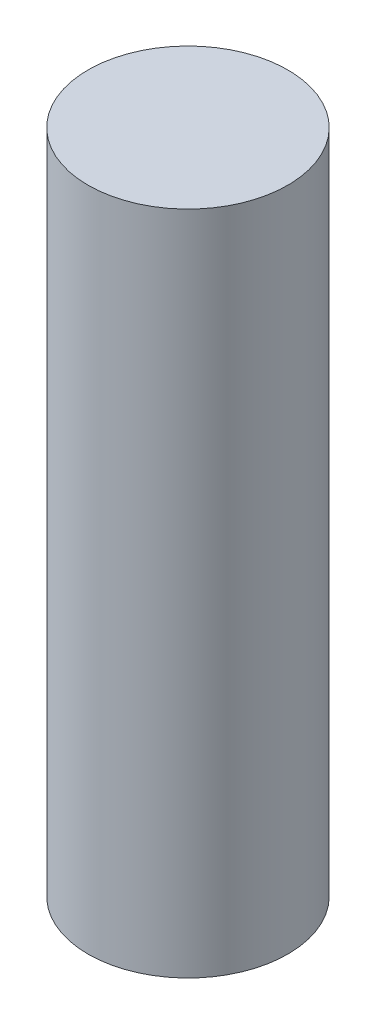
ISO-10303-21;
HEADER;
FILE_DESCRIPTION(('STEP AP214'),'2;1');
FILE_NAME('part.step','',(''),(''),'','','');
FILE_SCHEMA(('AUTOMOTIVE_DESIGN { 1 0 10303 214 1 1 1 1 }'));
ENDSEC;
DATA;
#1=APPLICATION_CONTEXT('core data for automotive mechanical design processes');
#2=APPLICATION_PROTOCOL_DEFINITION('international standard','automotive_design',2000,#1);
#3=PRODUCT_CONTEXT('',#1,'mechanical');
#4=PRODUCT('Part','Part','',(#3));
#5=PRODUCT_RELATED_PRODUCT_CATEGORY('part','',(#4));
#6=PRODUCT_DEFINITION_FORMATION('','',#4);
#7=PRODUCT_DEFINITION_CONTEXT('part definition',#1,'design');
#8=PRODUCT_DEFINITION('design','',#6,#7);
#9=PRODUCT_DEFINITION_SHAPE('','',#8);
#10=(LENGTH_UNIT() NAMED_UNIT(*) SI_UNIT(.MILLI.,.METRE.));
#11=(NAMED_UNIT(*) PLANE_ANGLE_UNIT() SI_UNIT($,.RADIAN.));
#12=(NAMED_UNIT(*) SI_UNIT($,.STERADIAN.) SOLID_ANGLE_UNIT());
#13=UNCERTAINTY_MEASURE_WITH_UNIT(LENGTH_MEASURE(1.E-05),#10,'distance_accuracy_value','');
#14=(GEOMETRIC_REPRESENTATION_CONTEXT(3) GLOBAL_UNCERTAINTY_ASSIGNED_CONTEXT((#13)) GLOBAL_UNIT_ASSIGNED_CONTEXT((#10,
#11,#12)) REPRESENTATION_CONTEXT('',''));
#15=CARTESIAN_POINT('',(0.,0.,0.));
#16=DIRECTION('',(0.,0.,1.));
#17=DIRECTION('',(1.,0.,0.));
#18=AXIS2_PLACEMENT_3D('',#15,#16,#17);
#19=CARTESIAN_POINT('',(22.352,20.32,0.));
#20=DIRECTION('',(0.,-1.,0.));
#21=DIRECTION('',(0.,0.,-1.));
#22=AXIS2_PLACEMENT_3D('',#19,#20,#21);
#23=CYLINDRICAL_SURFACE('',#22,3.048);
#24=CARTESIAN_POINT('',(22.352,20.32,0.));
#25=DIRECTION('',(0.,1.,0.));
#26=DIRECTION('',(0.,0.,1.));
#27=AXIS2_PLACEMENT_3D('',#24,#25,#26);
#28=CIRCLE('',#27,3.048);
#29=CARTESIAN_POINT('',(22.352,20.32,3.048));
#30=VERTEX_POINT('',#29);
#31=EDGE_CURVE('E10',#30,#30,#28,.T.);
#32=ORIENTED_EDGE('',*,*,#31,.F.);
#33=EDGE_LOOP('',(#32));
#34=FACE_BOUND('',#33,.T.);
#35=CARTESIAN_POINT('',(22.352,0.,0.));
#36=DIRECTION('',(0.,1.,0.));
#37=DIRECTION('',(0.,0.,1.));
#38=AXIS2_PLACEMENT_3D('',#35,#36,#37);
#39=CIRCLE('',#38,3.048);
#40=CARTESIAN_POINT('',(22.352,0.,3.048));
#41=VERTEX_POINT('',#40);
#42=EDGE_CURVE('E40',#41,#41,#39,.T.);
#43=ORIENTED_EDGE('',*,*,#42,.T.);
#44=EDGE_LOOP('',(#43));
#45=FACE_BOUND('',#44,.T.);
#46=ADVANCED_FACE('F37',(#34,#45),#23,.T.);
#47=CARTESIAN_POINT('',(22.352,20.32,0.));
#48=DIRECTION('',(0.,1.,0.));
#49=DIRECTION('',(0.,0.,1.));
#50=AXIS2_PLACEMENT_3D('',#47,#48,#49);
#51=PLANE('',#50);
#52=ORIENTED_EDGE('',*,*,#31,.T.);
#53=EDGE_LOOP('',(#52));
#54=FACE_BOUND('',#53,.T.);
#55=ADVANCED_FACE('F52',(#54),#51,.T.);
#56=CARTESIAN_POINT('',(22.352,0.,0.));
#57=DIRECTION('',(0.,1.,0.));
#58=DIRECTION('',(0.,0.,1.));
#59=AXIS2_PLACEMENT_3D('',#56,#57,#58);
#60=PLANE('',#59);
#61=ORIENTED_EDGE('',*,*,#42,.F.);
#62=EDGE_LOOP('',(#61));
#63=FACE_BOUND('',#62,.T.);
#64=ADVANCED_FACE('F50',(#63),#60,.F.);
#65=CLOSED_SHELL('',(#46,#55,#64));
#66=MANIFOLD_SOLID_BREP('B2',#65);
#67=ADVANCED_BREP_SHAPE_REPRESENTATION('',(#18,#66),#14);
#68=SHAPE_DEFINITION_REPRESENTATION(#9,#67);
ENDSEC;
END-ISO-10303-21;
